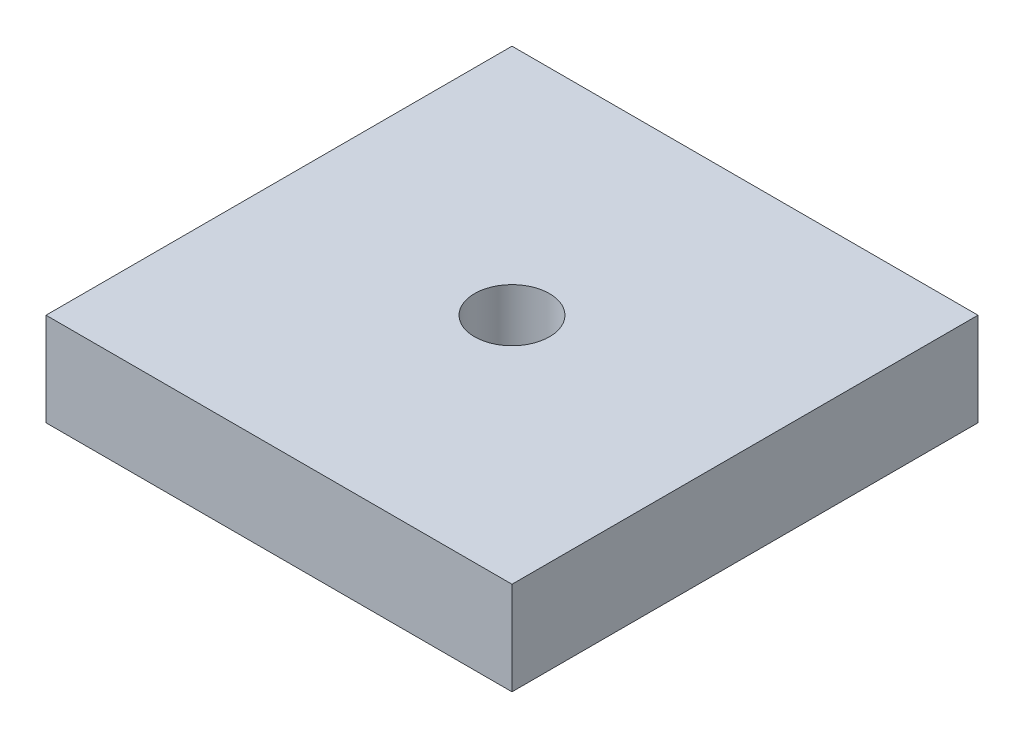
ISO-10303-21;
HEADER;
FILE_DESCRIPTION(('STEP AP214'),'2;1');
FILE_NAME('part.step','',(''),(''),'','','');
FILE_SCHEMA(('AUTOMOTIVE_DESIGN { 1 0 10303 214 1 1 1 1 }'));
ENDSEC;
DATA;
#1=APPLICATION_CONTEXT('core data for automotive mechanical design processes');
#2=APPLICATION_PROTOCOL_DEFINITION('international standard','automotive_design',2000,#1);
#3=PRODUCT_CONTEXT('',#1,'mechanical');
#4=PRODUCT('Part','Part','',(#3));
#5=PRODUCT_RELATED_PRODUCT_CATEGORY('part','',(#4));
#6=PRODUCT_DEFINITION_FORMATION('','',#4);
#7=PRODUCT_DEFINITION_CONTEXT('part definition',#1,'design');
#8=PRODUCT_DEFINITION('design','',#6,#7);
#9=PRODUCT_DEFINITION_SHAPE('','',#8);
#10=(LENGTH_UNIT() NAMED_UNIT(*) SI_UNIT(.MILLI.,.METRE.));
#11=(NAMED_UNIT(*) PLANE_ANGLE_UNIT() SI_UNIT($,.RADIAN.));
#12=(NAMED_UNIT(*) SI_UNIT($,.STERADIAN.) SOLID_ANGLE_UNIT());
#13=UNCERTAINTY_MEASURE_WITH_UNIT(LENGTH_MEASURE(1.E-05),#10,'distance_accuracy_value','');
#14=(GEOMETRIC_REPRESENTATION_CONTEXT(3) GLOBAL_UNCERTAINTY_ASSIGNED_CONTEXT((#13)) GLOBAL_UNIT_ASSIGNED_CONTEXT((#10,
#11,#12)) REPRESENTATION_CONTEXT('',''));
#15=CARTESIAN_POINT('',(0.,0.,0.));
#16=DIRECTION('',(0.,0.,1.));
#17=DIRECTION('',(1.,0.,0.));
#18=AXIS2_PLACEMENT_3D('',#15,#16,#17);
#19=CARTESIAN_POINT('',(0.,6.35,0.));
#20=DIRECTION('',(0.,1.,0.));
#21=DIRECTION('',(0.,0.,1.));
#22=AXIS2_PLACEMENT_3D('',#19,#20,#21);
#23=PLANE('',#22);
#24=CARTESIAN_POINT('',(0.,6.35,0.));
#25=DIRECTION('',(0.,1.,0.));
#26=DIRECTION('',(0.,0.,1.));
#27=AXIS2_PLACEMENT_3D('',#24,#25,#26);
#28=CIRCLE('',#27,2.5527);
#29=CARTESIAN_POINT('',(0.,6.35,2.5527));
#30=VERTEX_POINT('',#29);
#31=EDGE_CURVE('P0_E19',#30,#30,#28,.F.);
#32=ORIENTED_EDGE('',*,*,#31,.T.);
#33=EDGE_LOOP('',(#32));
#34=FACE_BOUND('',#33,.T.);
#35=DIRECTION('',(-1.,0.,0.));
#36=VECTOR('',#35,1.);
#37=CARTESIAN_POINT('',(15.875,6.35,-15.875));
#38=LINE('',#37,#36);
#39=CARTESIAN_POINT('',(-15.875,6.35,-15.875));
#40=VERTEX_POINT('',#39);
#41=CARTESIAN_POINT('',(15.875,6.35,-15.875));
#42=VERTEX_POINT('',#41);
#43=EDGE_CURVE('P0_E69',#40,#42,#38,.F.);
#44=ORIENTED_EDGE('',*,*,#43,.F.);
#45=DIRECTION('',(0.,0.,1.));
#46=VECTOR('',#45,1.);
#47=CARTESIAN_POINT('',(-15.875,6.35,-15.875));
#48=LINE('',#47,#46);
#49=CARTESIAN_POINT('',(-15.875,6.35,15.875));
#50=VERTEX_POINT('',#49);
#51=EDGE_CURVE('P0_E66',#50,#40,#48,.F.);
#52=ORIENTED_EDGE('',*,*,#51,.F.);
#53=DIRECTION('',(1.,0.,0.));
#54=VECTOR('',#53,1.);
#55=CARTESIAN_POINT('',(-15.875,6.35,15.875));
#56=LINE('',#55,#54);
#57=CARTESIAN_POINT('',(15.875,6.35,15.875));
#58=VERTEX_POINT('',#57);
#59=EDGE_CURVE('P0_E57',#58,#50,#56,.F.);
#60=ORIENTED_EDGE('',*,*,#59,.F.);
#61=DIRECTION('',(0.,0.,-1.));
#62=VECTOR('',#61,1.);
#63=CARTESIAN_POINT('',(15.875,6.35,15.875));
#64=LINE('',#63,#62);
#65=EDGE_CURVE('P0_E52',#42,#58,#64,.F.);
#66=ORIENTED_EDGE('',*,*,#65,.F.);
#67=EDGE_LOOP('',(#44,#52,#60,#66));
#68=FACE_BOUND('',#67,.T.);
#69=ADVANCED_FACE('P0_F16',(#34,#68),#23,.T.);
#70=CARTESIAN_POINT('',(-15.875,0.,-15.875));
#71=DIRECTION('',(-1.,0.,0.));
#72=DIRECTION('',(0.,0.,1.));
#73=AXIS2_PLACEMENT_3D('',#70,#71,#72);
#74=PLANE('',#73);
#75=DIRECTION('',(0.,1.,0.));
#76=VECTOR('',#75,1.);
#77=CARTESIAN_POINT('',(-15.875,0.,-15.875));
#78=LINE('',#77,#76);
#79=CARTESIAN_POINT('',(-15.875,0.,-15.875));
#80=VERTEX_POINT('',#79);
#81=EDGE_CURVE('P0_E81',#80,#40,#78,.T.);
#82=ORIENTED_EDGE('',*,*,#81,.F.);
#83=DIRECTION('',(0.,0.,1.));
#84=VECTOR('',#83,1.);
#85=CARTESIAN_POINT('',(-15.875,0.,0.));
#86=LINE('',#85,#84);
#87=CARTESIAN_POINT('',(-15.875,0.,15.875));
#88=VERTEX_POINT('',#87);
#89=EDGE_CURVE('P0_E76',#80,#88,#86,.T.);
#90=ORIENTED_EDGE('',*,*,#89,.T.);
#91=DIRECTION('',(0.,1.,0.));
#92=VECTOR('',#91,1.);
#93=CARTESIAN_POINT('',(-15.875,0.,15.875));
#94=LINE('',#93,#92);
#95=EDGE_CURVE('P0_E62',#50,#88,#94,.F.);
#96=ORIENTED_EDGE('',*,*,#95,.F.);
#97=ORIENTED_EDGE('',*,*,#51,.T.);
#98=EDGE_LOOP('',(#82,#90,#96,#97));
#99=FACE_BOUND('',#98,.T.);
#100=ADVANCED_FACE('P0_F75',(#99),#74,.T.);
#101=CARTESIAN_POINT('',(-15.875,0.,15.875));
#102=DIRECTION('',(0.,0.,1.));
#103=DIRECTION('',(1.,0.,0.));
#104=AXIS2_PLACEMENT_3D('',#101,#102,#103);
#105=PLANE('',#104);
#106=ORIENTED_EDGE('',*,*,#95,.T.);
#107=DIRECTION('',(1.,0.,0.));
#108=VECTOR('',#107,1.);
#109=CARTESIAN_POINT('',(0.,0.,15.875));
#110=LINE('',#109,#108);
#111=CARTESIAN_POINT('',(15.875,0.,15.875));
#112=VERTEX_POINT('',#111);
#113=EDGE_CURVE('P0_E86',#88,#112,#110,.T.);
#114=ORIENTED_EDGE('',*,*,#113,.T.);
#115=DIRECTION('',(0.,1.,0.));
#116=VECTOR('',#115,1.);
#117=CARTESIAN_POINT('',(15.875,0.,15.875));
#118=LINE('',#117,#116);
#119=EDGE_CURVE('P0_E64',#58,#112,#118,.F.);
#120=ORIENTED_EDGE('',*,*,#119,.F.);
#121=ORIENTED_EDGE('',*,*,#59,.T.);
#122=EDGE_LOOP('',(#106,#114,#120,#121));
#123=FACE_BOUND('',#122,.T.);
#124=ADVANCED_FACE('P0_F59',(#123),#105,.T.);
#125=CARTESIAN_POINT('',(15.875,0.,15.875));
#126=DIRECTION('',(1.,0.,0.));
#127=DIRECTION('',(0.,0.,-1.));
#128=AXIS2_PLACEMENT_3D('',#125,#126,#127);
#129=PLANE('',#128);
#130=ORIENTED_EDGE('',*,*,#119,.T.);
#131=DIRECTION('',(0.,0.,1.));
#132=VECTOR('',#131,1.);
#133=CARTESIAN_POINT('',(15.875,0.,0.));
#134=LINE('',#133,#132);
#135=CARTESIAN_POINT('',(15.875,0.,-15.875));
#136=VERTEX_POINT('',#135);
#137=EDGE_CURVE('P0_E88',#112,#136,#134,.F.);
#138=ORIENTED_EDGE('',*,*,#137,.T.);
#139=DIRECTION('',(0.,1.,0.));
#140=VECTOR('',#139,1.);
#141=CARTESIAN_POINT('',(15.875,0.,-15.875));
#142=LINE('',#141,#140);
#143=EDGE_CURVE('P0_E33',#42,#136,#142,.F.);
#144=ORIENTED_EDGE('',*,*,#143,.F.);
#145=ORIENTED_EDGE('',*,*,#65,.T.);
#146=EDGE_LOOP('',(#130,#138,#144,#145));
#147=FACE_BOUND('',#146,.T.);
#148=ADVANCED_FACE('P0_F95',(#147),#129,.T.);
#149=CARTESIAN_POINT('',(15.875,0.,-15.875));
#150=DIRECTION('',(0.,0.,-1.));
#151=DIRECTION('',(-1.,0.,0.));
#152=AXIS2_PLACEMENT_3D('',#149,#150,#151);
#153=PLANE('',#152);
#154=ORIENTED_EDGE('',*,*,#143,.T.);
#155=DIRECTION('',(1.,0.,0.));
#156=VECTOR('',#155,1.);
#157=CARTESIAN_POINT('',(0.,0.,-15.875));
#158=LINE('',#157,#156);
#159=EDGE_CURVE('P0_E25',#136,#80,#158,.F.);
#160=ORIENTED_EDGE('',*,*,#159,.T.);
#161=ORIENTED_EDGE('',*,*,#81,.T.);
#162=ORIENTED_EDGE('',*,*,#43,.T.);
#163=EDGE_LOOP('',(#154,#160,#161,#162));
#164=FACE_BOUND('',#163,.T.);
#165=ADVANCED_FACE('P0_F91',(#164),#153,.T.);
#166=CARTESIAN_POINT('',(0.,-0.3175,0.));
#167=DIRECTION('',(0.,1.,0.));
#168=DIRECTION('',(0.,0.,1.));
#169=AXIS2_PLACEMENT_3D('',#166,#167,#168);
#170=CYLINDRICAL_SURFACE('',#169,2.5527);
#171=ORIENTED_EDGE('',*,*,#31,.F.);
#172=EDGE_LOOP('',(#171));
#173=FACE_BOUND('',#172,.T.);
#174=CARTESIAN_POINT('',(0.,0.,0.));
#175=DIRECTION('',(0.,1.,0.));
#176=DIRECTION('',(0.,0.,1.));
#177=AXIS2_PLACEMENT_3D('',#174,#175,#176);
#178=CIRCLE('',#177,2.5527);
#179=CARTESIAN_POINT('',(0.,0.,2.5527));
#180=VERTEX_POINT('',#179);
#181=EDGE_CURVE('P0_E11',#180,#180,#178,.F.);
#182=ORIENTED_EDGE('',*,*,#181,.T.);
#183=EDGE_LOOP('',(#182));
#184=FACE_BOUND('',#183,.T.);
#185=ADVANCED_FACE('P0_F103',(#173,#184),#170,.F.);
#186=CARTESIAN_POINT('',(0.,0.,0.));
#187=DIRECTION('',(0.,1.,0.));
#188=DIRECTION('',(0.,0.,1.));
#189=AXIS2_PLACEMENT_3D('',#186,#187,#188);
#190=PLANE('',#189);
#191=ORIENTED_EDGE('',*,*,#181,.F.);
#192=EDGE_LOOP('',(#191));
#193=FACE_BOUND('',#192,.T.);
#194=ORIENTED_EDGE('',*,*,#137,.F.);
#195=ORIENTED_EDGE('',*,*,#113,.F.);
#196=ORIENTED_EDGE('',*,*,#89,.F.);
#197=ORIENTED_EDGE('',*,*,#159,.F.);
#198=EDGE_LOOP('',(#194,#195,#196,#197));
#199=FACE_BOUND('',#198,.T.);
#200=ADVANCED_FACE('P0_F94',(#193,#199),#190,.F.);
#201=CLOSED_SHELL('',(#69,#100,#124,#148,#165,#185,#200));
#202=MANIFOLD_SOLID_BREP('P0_B1',#201);
#203=CARTESIAN_POINT('',(0.,-0.3175,0.));
#204=DIRECTION('',(0.,1.,0.));
#205=DIRECTION('',(0.,0.,1.));
#206=AXIS2_PLACEMENT_3D('',#203,#204,#205);
#207=CYLINDRICAL_SURFACE('',#206,3.175);
#208=CARTESIAN_POINT('',(0.,6.35,0.));
#209=DIRECTION('',(0.,1.,0.));
#210=DIRECTION('',(0.,0.,1.));
#211=AXIS2_PLACEMENT_3D('',#208,#209,#210);
#212=CIRCLE('',#211,3.175);
#213=CARTESIAN_POINT('',(0.,6.35,3.175));
#214=VERTEX_POINT('',#213);
#215=EDGE_CURVE('P1_E10',#214,#214,#212,.F.);
#216=ORIENTED_EDGE('',*,*,#215,.T.);
#217=EDGE_LOOP('',(#216));
#218=FACE_BOUND('',#217,.T.);
#219=CARTESIAN_POINT('',(0.,0.,0.));
#220=DIRECTION('',(0.,1.,0.));
#221=DIRECTION('',(0.,0.,1.));
#222=AXIS2_PLACEMENT_3D('',#219,#220,#221);
#223=CIRCLE('',#222,3.175);
#224=CARTESIAN_POINT('',(0.,0.,3.175));
#225=VERTEX_POINT('',#224);
#226=EDGE_CURVE('P1_E15',#225,#225,#223,.T.);
#227=ORIENTED_EDGE('',*,*,#226,.T.);
#228=EDGE_LOOP('',(#227));
#229=FACE_BOUND('',#228,.T.);
#230=ADVANCED_FACE('P1_F14',(#218,#229),#207,.T.);
#231=OPEN_SHELL('',(#230));
#232=SHELL_BASED_SURFACE_MODEL('P1_B1',(#231));
#233=ADVANCED_BREP_SHAPE_REPRESENTATION('',(#18,#202),#14);
#234=MANIFOLD_SURFACE_SHAPE_REPRESENTATION('',(#18,#232),#14);
#235=SHAPE_REPRESENTATION('',(#18),#14);
#236=SHAPE_DEFINITION_REPRESENTATION(#9,#235);
#237=SHAPE_REPRESENTATION_RELATIONSHIP('','',#235,#233);
#238=SHAPE_REPRESENTATION_RELATIONSHIP('','',#235,#234);
ENDSEC;
END-ISO-10303-21;
